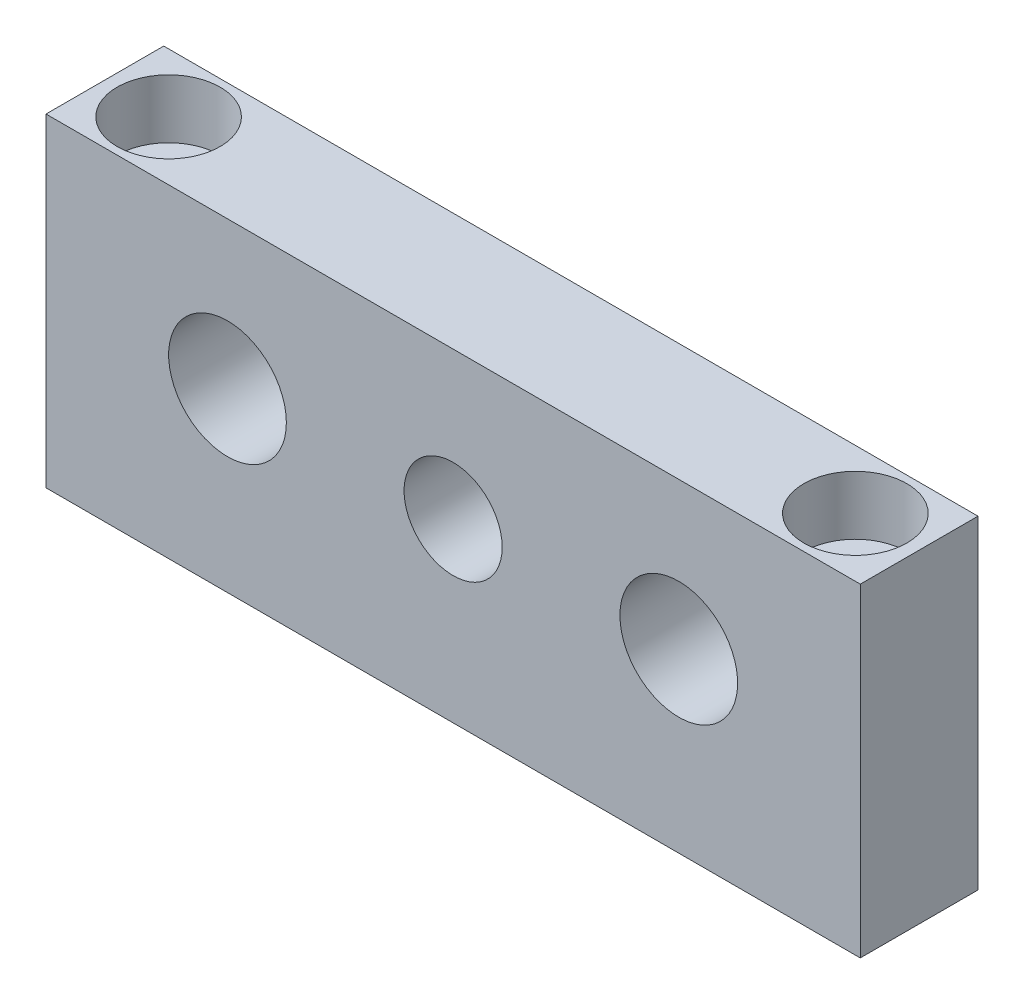
ISO-10303-21;
HEADER;
FILE_DESCRIPTION(('STEP AP214'),'2;1');
FILE_NAME('part.step','',(''),(''),'','','');
FILE_SCHEMA(('AUTOMOTIVE_DESIGN { 1 0 10303 214 1 1 1 1 }'));
ENDSEC;
DATA;
#1=APPLICATION_CONTEXT('core data for automotive mechanical design processes');
#2=APPLICATION_PROTOCOL_DEFINITION('international standard','automotive_design',2000,#1);
#3=PRODUCT_CONTEXT('',#1,'mechanical');
#4=PRODUCT('Part','Part','',(#3));
#5=PRODUCT_RELATED_PRODUCT_CATEGORY('part','',(#4));
#6=PRODUCT_DEFINITION_FORMATION('','',#4);
#7=PRODUCT_DEFINITION_CONTEXT('part definition',#1,'design');
#8=PRODUCT_DEFINITION('design','',#6,#7);
#9=PRODUCT_DEFINITION_SHAPE('','',#8);
#10=(LENGTH_UNIT() NAMED_UNIT(*) SI_UNIT(.MILLI.,.METRE.));
#11=(NAMED_UNIT(*) PLANE_ANGLE_UNIT() SI_UNIT($,.RADIAN.));
#12=(NAMED_UNIT(*) SI_UNIT($,.STERADIAN.) SOLID_ANGLE_UNIT());
#13=UNCERTAINTY_MEASURE_WITH_UNIT(LENGTH_MEASURE(1.E-05),#10,'distance_accuracy_value','');
#14=(GEOMETRIC_REPRESENTATION_CONTEXT(3) GLOBAL_UNCERTAINTY_ASSIGNED_CONTEXT((#13)) GLOBAL_UNIT_ASSIGNED_CONTEXT((#10,
#11,#12)) REPRESENTATION_CONTEXT('',''));
#15=CARTESIAN_POINT('',(0.,0.,0.));
#16=DIRECTION('',(0.,0.,1.));
#17=DIRECTION('',(1.,0.,0.));
#18=AXIS2_PLACEMENT_3D('',#15,#16,#17);
#19=CARTESIAN_POINT('',(35.,-16.5,6.));
#20=DIRECTION('',(0.,1.,0.));
#21=DIRECTION('',(0.,0.,1.));
#22=AXIS2_PLACEMENT_3D('',#19,#20,#21);
#23=CYLINDRICAL_SURFACE('',#22,3.);
#24=CARTESIAN_POINT('',(35.,-16.5,6.));
#25=DIRECTION('',(0.,1.,0.));
#26=DIRECTION('',(0.,0.,-1.));
#27=AXIS2_PLACEMENT_3D('',#24,#25,#26);
#28=CIRCLE('',#27,3.);
#29=CARTESIAN_POINT('',(35.,-16.5,3.));
#30=VERTEX_POINT('',#29);
#31=EDGE_CURVE('E115',#30,#30,#28,.T.);
#32=ORIENTED_EDGE('',*,*,#31,.F.);
#33=EDGE_LOOP('',(#32));
#34=FACE_BOUND('',#33,.T.);
#35=CARTESIAN_POINT('',(35.,10.5,6.));
#36=DIRECTION('',(0.,1.,0.));
#37=DIRECTION('',(0.,0.,1.));
#38=AXIS2_PLACEMENT_3D('',#35,#36,#37);
#39=CIRCLE('',#38,3.);
#40=CARTESIAN_POINT('',(35.,10.5,9.));
#41=VERTEX_POINT('',#40);
#42=EDGE_CURVE('E38',#41,#41,#39,.F.);
#43=ORIENTED_EDGE('',*,*,#42,.F.);
#44=EDGE_LOOP('',(#43));
#45=FACE_BOUND('',#44,.T.);
#46=ADVANCED_FACE('F34',(#34,#45),#23,.F.);
#47=CARTESIAN_POINT('',(-35.,-16.5,6.));
#48=DIRECTION('',(0.,1.,0.));
#49=DIRECTION('',(0.,0.,1.));
#50=AXIS2_PLACEMENT_3D('',#47,#48,#49);
#51=CYLINDRICAL_SURFACE('',#50,3.);
#52=CARTESIAN_POINT('',(-35.,-16.5,6.));
#53=DIRECTION('',(0.,1.,0.));
#54=DIRECTION('',(0.,0.,1.));
#55=AXIS2_PLACEMENT_3D('',#52,#53,#54);
#56=CIRCLE('',#55,3.);
#57=CARTESIAN_POINT('',(-35.,-16.5,9.));
#58=VERTEX_POINT('',#57);
#59=EDGE_CURVE('E130',#58,#58,#56,.T.);
#60=ORIENTED_EDGE('',*,*,#59,.F.);
#61=EDGE_LOOP('',(#60));
#62=FACE_BOUND('',#61,.T.);
#63=CARTESIAN_POINT('',(-35.,10.5,6.));
#64=DIRECTION('',(0.,1.,0.));
#65=DIRECTION('',(0.,0.,1.));
#66=AXIS2_PLACEMENT_3D('',#63,#64,#65);
#67=CIRCLE('',#66,3.);
#68=CARTESIAN_POINT('',(-35.,10.5,9.));
#69=VERTEX_POINT('',#68);
#70=EDGE_CURVE('E109',#69,#69,#67,.F.);
#71=ORIENTED_EDGE('',*,*,#70,.F.);
#72=EDGE_LOOP('',(#71));
#73=FACE_BOUND('',#72,.T.);
#74=ADVANCED_FACE('F172',(#62,#73),#51,.F.);
#75=CARTESIAN_POINT('',(41.5,-16.5,12.));
#76=DIRECTION('',(-1.,0.,0.));
#77=DIRECTION('',(0.,0.,1.));
#78=AXIS2_PLACEMENT_3D('',#75,#76,#77);
#79=PLANE('',#78);
#80=DIRECTION('',(0.,1.,0.));
#81=VECTOR('',#80,1.);
#82=CARTESIAN_POINT('',(41.5,-16.5,0.));
#83=LINE('',#82,#81);
#84=CARTESIAN_POINT('',(41.5,-16.5,0.));
#85=VERTEX_POINT('',#84);
#86=CARTESIAN_POINT('',(41.5,16.5,0.));
#87=VERTEX_POINT('',#86);
#88=EDGE_CURVE('E101',#85,#87,#83,.T.);
#89=ORIENTED_EDGE('',*,*,#88,.T.);
#90=DIRECTION('',(0.,0.,-1.));
#91=VECTOR('',#90,1.);
#92=CARTESIAN_POINT('',(41.5,16.5,12.));
#93=LINE('',#92,#91);
#94=CARTESIAN_POINT('',(41.5,16.5,12.));
#95=VERTEX_POINT('',#94);
#96=EDGE_CURVE('E11',#95,#87,#93,.T.);
#97=ORIENTED_EDGE('',*,*,#96,.F.);
#98=DIRECTION('',(0.,1.,0.));
#99=VECTOR('',#98,1.);
#100=CARTESIAN_POINT('',(41.5,-16.5,12.));
#101=LINE('',#100,#99);
#102=CARTESIAN_POINT('',(41.5,-16.5,12.));
#103=VERTEX_POINT('',#102);
#104=EDGE_CURVE('E88',#103,#95,#101,.T.);
#105=ORIENTED_EDGE('',*,*,#104,.F.);
#106=DIRECTION('',(0.,0.,-1.));
#107=VECTOR('',#106,1.);
#108=CARTESIAN_POINT('',(41.5,-16.5,12.));
#109=LINE('',#108,#107);
#110=EDGE_CURVE('E97',#103,#85,#109,.T.);
#111=ORIENTED_EDGE('',*,*,#110,.T.);
#112=EDGE_LOOP('',(#89,#97,#105,#111));
#113=FACE_BOUND('',#112,.T.);
#114=ADVANCED_FACE('F36',(#113),#79,.F.);
#115=CARTESIAN_POINT('',(-41.5,16.5,12.));
#116=DIRECTION('',(0.,-1.,0.));
#117=DIRECTION('',(0.,0.,-1.));
#118=AXIS2_PLACEMENT_3D('',#115,#116,#117);
#119=PLANE('',#118);
#120=CARTESIAN_POINT('',(-35.,16.5,6.));
#121=DIRECTION('',(0.,1.,0.));
#122=DIRECTION('',(0.,0.,1.));
#123=AXIS2_PLACEMENT_3D('',#120,#121,#122);
#124=CIRCLE('',#123,5.25);
#125=CARTESIAN_POINT('',(-35.,16.5,11.25));
#126=VERTEX_POINT('',#125);
#127=EDGE_CURVE('E117',#126,#126,#124,.T.);
#128=ORIENTED_EDGE('',*,*,#127,.F.);
#129=EDGE_LOOP('',(#128));
#130=FACE_BOUND('',#129,.T.);
#131=CARTESIAN_POINT('',(35.,16.5,6.));
#132=DIRECTION('',(0.,1.,0.));
#133=DIRECTION('',(0.,0.,1.));
#134=AXIS2_PLACEMENT_3D('',#131,#132,#133);
#135=CIRCLE('',#134,5.25);
#136=CARTESIAN_POINT('',(35.,16.5,11.25));
#137=VERTEX_POINT('',#136);
#138=EDGE_CURVE('E127',#137,#137,#135,.T.);
#139=ORIENTED_EDGE('',*,*,#138,.F.);
#140=EDGE_LOOP('',(#139));
#141=FACE_BOUND('',#140,.T.);
#142=DIRECTION('',(-1.,0.,0.));
#143=VECTOR('',#142,1.);
#144=CARTESIAN_POINT('',(-41.5,16.5,0.));
#145=LINE('',#144,#143);
#146=CARTESIAN_POINT('',(-41.5,16.5,0.));
#147=VERTEX_POINT('',#146);
#148=EDGE_CURVE('E92',#87,#147,#145,.T.);
#149=ORIENTED_EDGE('',*,*,#148,.T.);
#150=DIRECTION('',(0.,0.,-1.));
#151=VECTOR('',#150,1.);
#152=CARTESIAN_POINT('',(-41.5,16.5,12.));
#153=LINE('',#152,#151);
#154=CARTESIAN_POINT('',(-41.5,16.5,12.));
#155=VERTEX_POINT('',#154);
#156=EDGE_CURVE('E44',#155,#147,#153,.T.);
#157=ORIENTED_EDGE('',*,*,#156,.F.);
#158=DIRECTION('',(-1.,0.,0.));
#159=VECTOR('',#158,1.);
#160=CARTESIAN_POINT('',(-41.5,16.5,12.));
#161=LINE('',#160,#159);
#162=EDGE_CURVE('E83',#95,#155,#161,.T.);
#163=ORIENTED_EDGE('',*,*,#162,.F.);
#164=ORIENTED_EDGE('',*,*,#96,.T.);
#165=EDGE_LOOP('',(#149,#157,#163,#164));
#166=FACE_BOUND('',#165,.T.);
#167=ADVANCED_FACE('F91',(#130,#141,#166),#119,.F.);
#168=CARTESIAN_POINT('',(-41.5,-16.5,12.));
#169=DIRECTION('',(1.,0.,0.));
#170=DIRECTION('',(0.,0.,-1.));
#171=AXIS2_PLACEMENT_3D('',#168,#169,#170);
#172=PLANE('',#171);
#173=DIRECTION('',(0.,-1.,0.));
#174=VECTOR('',#173,1.);
#175=CARTESIAN_POINT('',(-41.5,-16.5,0.));
#176=LINE('',#175,#174);
#177=CARTESIAN_POINT('',(-41.5,-16.5,0.));
#178=VERTEX_POINT('',#177);
#179=EDGE_CURVE('E70',#147,#178,#176,.T.);
#180=ORIENTED_EDGE('',*,*,#179,.T.);
#181=DIRECTION('',(0.,0.,-1.));
#182=VECTOR('',#181,1.);
#183=CARTESIAN_POINT('',(-41.5,-16.5,12.));
#184=LINE('',#183,#182);
#185=CARTESIAN_POINT('',(-41.5,-16.5,12.));
#186=VERTEX_POINT('',#185);
#187=EDGE_CURVE('E93',#186,#178,#184,.T.);
#188=ORIENTED_EDGE('',*,*,#187,.F.);
#189=DIRECTION('',(0.,-1.,0.));
#190=VECTOR('',#189,1.);
#191=CARTESIAN_POINT('',(-41.5,-16.5,12.));
#192=LINE('',#191,#190);
#193=EDGE_CURVE('E86',#155,#186,#192,.T.);
#194=ORIENTED_EDGE('',*,*,#193,.F.);
#195=ORIENTED_EDGE('',*,*,#156,.T.);
#196=EDGE_LOOP('',(#180,#188,#194,#195));
#197=FACE_BOUND('',#196,.T.);
#198=ADVANCED_FACE('F95',(#197),#172,.F.);
#199=CARTESIAN_POINT('',(-41.5,-16.5,12.));
#200=DIRECTION('',(0.,1.,0.));
#201=DIRECTION('',(0.,0.,1.));
#202=AXIS2_PLACEMENT_3D('',#199,#200,#201);
#203=PLANE('',#202);
#204=ORIENTED_EDGE('',*,*,#59,.T.);
#205=EDGE_LOOP('',(#204));
#206=FACE_BOUND('',#205,.T.);
#207=ORIENTED_EDGE('',*,*,#31,.T.);
#208=EDGE_LOOP('',(#207));
#209=FACE_BOUND('',#208,.T.);
#210=DIRECTION('',(1.,0.,0.));
#211=VECTOR('',#210,1.);
#212=CARTESIAN_POINT('',(-41.5,-16.5,0.));
#213=LINE('',#212,#211);
#214=EDGE_CURVE('E76',#178,#85,#213,.T.);
#215=ORIENTED_EDGE('',*,*,#214,.T.);
#216=ORIENTED_EDGE('',*,*,#110,.F.);
#217=DIRECTION('',(1.,0.,0.));
#218=VECTOR('',#217,1.);
#219=CARTESIAN_POINT('',(-41.5,-16.5,12.));
#220=LINE('',#219,#218);
#221=EDGE_CURVE('E53',#186,#103,#220,.T.);
#222=ORIENTED_EDGE('',*,*,#221,.F.);
#223=ORIENTED_EDGE('',*,*,#187,.T.);
#224=EDGE_LOOP('',(#215,#216,#222,#223));
#225=FACE_BOUND('',#224,.T.);
#226=ADVANCED_FACE('F157',(#206,#209,#225),#203,.F.);
#227=CARTESIAN_POINT('',(0.,0.,12.));
#228=DIRECTION('',(0.,0.,-1.));
#229=DIRECTION('',(-1.,0.,0.));
#230=AXIS2_PLACEMENT_3D('',#227,#228,#229);
#231=PLANE('',#230);
#232=CARTESIAN_POINT('',(23.,1.5,12.));
#233=DIRECTION('',(0.,0.,1.));
#234=DIRECTION('',(-1.,0.,0.));
#235=AXIS2_PLACEMENT_3D('',#232,#233,#234);
#236=CIRCLE('',#235,6.);
#237=CARTESIAN_POINT('',(17.,1.5,12.));
#238=VERTEX_POINT('',#237);
#239=EDGE_CURVE('E133',#238,#238,#236,.T.);
#240=ORIENTED_EDGE('',*,*,#239,.F.);
#241=EDGE_LOOP('',(#240));
#242=FACE_BOUND('',#241,.T.);
#243=CARTESIAN_POINT('',(-23.,1.5,12.));
#244=DIRECTION('',(0.,0.,1.));
#245=DIRECTION('',(1.,0.,0.));
#246=AXIS2_PLACEMENT_3D('',#243,#244,#245);
#247=CIRCLE('',#246,6.);
#248=CARTESIAN_POINT('',(-17.,1.5,12.));
#249=VERTEX_POINT('',#248);
#250=EDGE_CURVE('E140',#249,#249,#247,.T.);
#251=ORIENTED_EDGE('',*,*,#250,.F.);
#252=EDGE_LOOP('',(#251));
#253=FACE_BOUND('',#252,.T.);
#254=CARTESIAN_POINT('',(0.,1.5,12.));
#255=DIRECTION('',(0.,0.,1.));
#256=DIRECTION('',(1.,0.,0.));
#257=AXIS2_PLACEMENT_3D('',#254,#255,#256);
#258=CIRCLE('',#257,5.);
#259=CARTESIAN_POINT('',(5.,1.5,12.));
#260=VERTEX_POINT('',#259);
#261=EDGE_CURVE('E139',#260,#260,#258,.T.);
#262=ORIENTED_EDGE('',*,*,#261,.F.);
#263=EDGE_LOOP('',(#262));
#264=FACE_BOUND('',#263,.T.);
#265=ORIENTED_EDGE('',*,*,#104,.T.);
#266=ORIENTED_EDGE('',*,*,#162,.T.);
#267=ORIENTED_EDGE('',*,*,#193,.T.);
#268=ORIENTED_EDGE('',*,*,#221,.T.);
#269=EDGE_LOOP('',(#265,#266,#267,#268));
#270=FACE_BOUND('',#269,.T.);
#271=ADVANCED_FACE('F84',(#242,#253,#264,#270),#231,.F.);
#272=CARTESIAN_POINT('',(0.,0.,0.));
#273=DIRECTION('',(0.,0.,-1.));
#274=DIRECTION('',(-1.,0.,0.));
#275=AXIS2_PLACEMENT_3D('',#272,#273,#274);
#276=PLANE('',#275);
#277=CARTESIAN_POINT('',(23.,1.5,0.));
#278=DIRECTION('',(0.,0.,1.));
#279=DIRECTION('',(-1.,0.,0.));
#280=AXIS2_PLACEMENT_3D('',#277,#278,#279);
#281=CIRCLE('',#280,6.);
#282=CARTESIAN_POINT('',(17.,1.5,0.));
#283=VERTEX_POINT('',#282);
#284=EDGE_CURVE('E143',#283,#283,#281,.T.);
#285=ORIENTED_EDGE('',*,*,#284,.T.);
#286=EDGE_LOOP('',(#285));
#287=FACE_BOUND('',#286,.T.);
#288=CARTESIAN_POINT('',(-23.,1.5,0.));
#289=DIRECTION('',(0.,0.,1.));
#290=DIRECTION('',(1.,0.,0.));
#291=AXIS2_PLACEMENT_3D('',#288,#289,#290);
#292=CIRCLE('',#291,6.);
#293=CARTESIAN_POINT('',(-17.,1.5,0.));
#294=VERTEX_POINT('',#293);
#295=EDGE_CURVE('E136',#294,#294,#292,.T.);
#296=ORIENTED_EDGE('',*,*,#295,.T.);
#297=EDGE_LOOP('',(#296));
#298=FACE_BOUND('',#297,.T.);
#299=CARTESIAN_POINT('',(0.,1.5,0.));
#300=DIRECTION('',(0.,0.,1.));
#301=DIRECTION('',(1.,0.,0.));
#302=AXIS2_PLACEMENT_3D('',#299,#300,#301);
#303=CIRCLE('',#302,5.);
#304=CARTESIAN_POINT('',(5.,1.5,0.));
#305=VERTEX_POINT('',#304);
#306=EDGE_CURVE('E104',#305,#305,#303,.T.);
#307=ORIENTED_EDGE('',*,*,#306,.T.);
#308=EDGE_LOOP('',(#307));
#309=FACE_BOUND('',#308,.T.);
#310=ORIENTED_EDGE('',*,*,#88,.F.);
#311=ORIENTED_EDGE('',*,*,#214,.F.);
#312=ORIENTED_EDGE('',*,*,#179,.F.);
#313=ORIENTED_EDGE('',*,*,#148,.F.);
#314=EDGE_LOOP('',(#310,#311,#312,#313));
#315=FACE_BOUND('',#314,.T.);
#316=ADVANCED_FACE('F156',(#287,#298,#309,#315),#276,.T.);
#317=CARTESIAN_POINT('',(0.,1.5,0.));
#318=DIRECTION('',(0.,0.,1.));
#319=DIRECTION('',(1.,0.,0.));
#320=AXIS2_PLACEMENT_3D('',#317,#318,#319);
#321=CYLINDRICAL_SURFACE('',#320,5.);
#322=ORIENTED_EDGE('',*,*,#306,.F.);
#323=EDGE_LOOP('',(#322));
#324=FACE_BOUND('',#323,.T.);
#325=ORIENTED_EDGE('',*,*,#261,.T.);
#326=EDGE_LOOP('',(#325));
#327=FACE_BOUND('',#326,.T.);
#328=ADVANCED_FACE('F153',(#324,#327),#321,.F.);
#329=CARTESIAN_POINT('',(-23.,1.5,0.));
#330=DIRECTION('',(0.,0.,1.));
#331=DIRECTION('',(1.,0.,0.));
#332=AXIS2_PLACEMENT_3D('',#329,#330,#331);
#333=CYLINDRICAL_SURFACE('',#332,6.);
#334=ORIENTED_EDGE('',*,*,#295,.F.);
#335=EDGE_LOOP('',(#334));
#336=FACE_BOUND('',#335,.T.);
#337=ORIENTED_EDGE('',*,*,#250,.T.);
#338=EDGE_LOOP('',(#337));
#339=FACE_BOUND('',#338,.T.);
#340=ADVANCED_FACE('F184',(#336,#339),#333,.F.);
#341=CARTESIAN_POINT('',(23.,1.5,0.));
#342=DIRECTION('',(0.,0.,1.));
#343=DIRECTION('',(1.,0.,0.));
#344=AXIS2_PLACEMENT_3D('',#341,#342,#343);
#345=CYLINDRICAL_SURFACE('',#344,6.);
#346=ORIENTED_EDGE('',*,*,#284,.F.);
#347=EDGE_LOOP('',(#346));
#348=FACE_BOUND('',#347,.T.);
#349=ORIENTED_EDGE('',*,*,#239,.T.);
#350=EDGE_LOOP('',(#349));
#351=FACE_BOUND('',#350,.T.);
#352=ADVANCED_FACE('F187',(#348,#351),#345,.F.);
#353=CARTESIAN_POINT('',(-35.,10.5,6.));
#354=DIRECTION('',(0.,1.,0.));
#355=DIRECTION('',(0.,0.,1.));
#356=AXIS2_PLACEMENT_3D('',#353,#354,#355);
#357=PLANE('',#356);
#358=CARTESIAN_POINT('',(-35.,10.5,6.));
#359=DIRECTION('',(0.,1.,0.));
#360=DIRECTION('',(0.,0.,1.));
#361=AXIS2_PLACEMENT_3D('',#358,#359,#360);
#362=CIRCLE('',#361,5.25);
#363=CARTESIAN_POINT('',(-35.,10.5,11.25));
#364=VERTEX_POINT('',#363);
#365=EDGE_CURVE('E111',#364,#364,#362,.T.);
#366=ORIENTED_EDGE('',*,*,#365,.T.);
#367=EDGE_LOOP('',(#366));
#368=FACE_BOUND('',#367,.T.);
#369=ORIENTED_EDGE('',*,*,#70,.T.);
#370=EDGE_LOOP('',(#369));
#371=FACE_BOUND('',#370,.T.);
#372=ADVANCED_FACE('F190',(#368,#371),#357,.T.);
#373=CARTESIAN_POINT('',(-35.,10.5,6.));
#374=DIRECTION('',(0.,1.,0.));
#375=DIRECTION('',(0.,0.,1.));
#376=AXIS2_PLACEMENT_3D('',#373,#374,#375);
#377=CYLINDRICAL_SURFACE('',#376,5.25);
#378=ORIENTED_EDGE('',*,*,#365,.F.);
#379=EDGE_LOOP('',(#378));
#380=FACE_BOUND('',#379,.T.);
#381=ORIENTED_EDGE('',*,*,#127,.T.);
#382=EDGE_LOOP('',(#381));
#383=FACE_BOUND('',#382,.T.);
#384=ADVANCED_FACE('F221',(#380,#383),#377,.F.);
#385=CARTESIAN_POINT('',(35.,10.5,6.));
#386=DIRECTION('',(0.,1.,0.));
#387=DIRECTION('',(0.,0.,1.));
#388=AXIS2_PLACEMENT_3D('',#385,#386,#387);
#389=PLANE('',#388);
#390=CARTESIAN_POINT('',(35.,10.5,6.));
#391=DIRECTION('',(0.,1.,0.));
#392=DIRECTION('',(0.,0.,1.));
#393=AXIS2_PLACEMENT_3D('',#390,#391,#392);
#394=CIRCLE('',#393,5.25);
#395=CARTESIAN_POINT('',(35.,10.5,11.25));
#396=VERTEX_POINT('',#395);
#397=EDGE_CURVE('E122',#396,#396,#394,.T.);
#398=ORIENTED_EDGE('',*,*,#397,.T.);
#399=EDGE_LOOP('',(#398));
#400=FACE_BOUND('',#399,.T.);
#401=ORIENTED_EDGE('',*,*,#42,.T.);
#402=EDGE_LOOP('',(#401));
#403=FACE_BOUND('',#402,.T.);
#404=ADVANCED_FACE('F216',(#400,#403),#389,.T.);
#405=CARTESIAN_POINT('',(35.,10.5,6.));
#406=DIRECTION('',(0.,1.,0.));
#407=DIRECTION('',(0.,0.,1.));
#408=AXIS2_PLACEMENT_3D('',#405,#406,#407);
#409=CYLINDRICAL_SURFACE('',#408,5.25);
#410=ORIENTED_EDGE('',*,*,#397,.F.);
#411=EDGE_LOOP('',(#410));
#412=FACE_BOUND('',#411,.T.);
#413=ORIENTED_EDGE('',*,*,#138,.T.);
#414=EDGE_LOOP('',(#413));
#415=FACE_BOUND('',#414,.T.);
#416=ADVANCED_FACE('F214',(#412,#415),#409,.F.);
#417=CLOSED_SHELL('',(#46,#74,#114,#167,#198,#226,#271,#316,#328,#340,#352,#372,#384,#404,#416));
#418=MANIFOLD_SOLID_BREP('B2',#417);
#419=ADVANCED_BREP_SHAPE_REPRESENTATION('',(#18,#418),#14);
#420=SHAPE_DEFINITION_REPRESENTATION(#9,#419);
ENDSEC;
END-ISO-10303-21;
